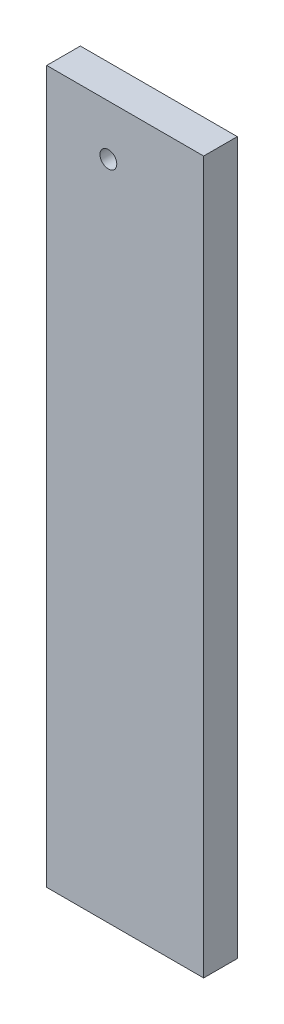
ISO-10303-21;
HEADER;
FILE_DESCRIPTION(('STEP AP214'),'2;1');
FILE_NAME('part.step','',(''),(''),'','','');
FILE_SCHEMA(('AUTOMOTIVE_DESIGN { 1 0 10303 214 1 1 1 1 }'));
ENDSEC;
DATA;
#1=APPLICATION_CONTEXT('core data for automotive mechanical design processes');
#2=APPLICATION_PROTOCOL_DEFINITION('international standard','automotive_design',2000,#1);
#3=PRODUCT_CONTEXT('',#1,'mechanical');
#4=PRODUCT('Part','Part','',(#3));
#5=PRODUCT_RELATED_PRODUCT_CATEGORY('part','',(#4));
#6=PRODUCT_DEFINITION_FORMATION('','',#4);
#7=PRODUCT_DEFINITION_CONTEXT('part definition',#1,'design');
#8=PRODUCT_DEFINITION('design','',#6,#7);
#9=PRODUCT_DEFINITION_SHAPE('','',#8);
#10=(LENGTH_UNIT() NAMED_UNIT(*) SI_UNIT(.MILLI.,.METRE.));
#11=(NAMED_UNIT(*) PLANE_ANGLE_UNIT() SI_UNIT($,.RADIAN.));
#12=(NAMED_UNIT(*) SI_UNIT($,.STERADIAN.) SOLID_ANGLE_UNIT());
#13=UNCERTAINTY_MEASURE_WITH_UNIT(LENGTH_MEASURE(1.E-05),#10,'distance_accuracy_value','');
#14=(GEOMETRIC_REPRESENTATION_CONTEXT(3) GLOBAL_UNCERTAINTY_ASSIGNED_CONTEXT((#13)) GLOBAL_UNIT_ASSIGNED_CONTEXT((#10,
#11,#12)) REPRESENTATION_CONTEXT('',''));
#15=CARTESIAN_POINT('',(0.,0.,0.));
#16=DIRECTION('',(0.,0.,1.));
#17=DIRECTION('',(1.,0.,0.));
#18=AXIS2_PLACEMENT_3D('',#15,#16,#17);
#19=CARTESIAN_POINT('',(-44.45,201.6125,9.525));
#20=DIRECTION('',(1.,0.,0.));
#21=DIRECTION('',(0.,1.,0.));
#22=AXIS2_PLACEMENT_3D('',#19,#20,#21);
#23=PLANE('',#22);
#24=DIRECTION('',(0.,-1.,0.));
#25=VECTOR('',#24,1.);
#26=CARTESIAN_POINT('',(-44.45,201.6125,-9.525));
#27=LINE('',#26,#25);
#28=CARTESIAN_POINT('',(-44.45,201.6125,-9.525));
#29=VERTEX_POINT('',#28);
#30=CARTESIAN_POINT('',(-44.45,-201.6125,-9.525));
#31=VERTEX_POINT('',#30);
#32=EDGE_CURVE('E95',#29,#31,#27,.T.);
#33=ORIENTED_EDGE('',*,*,#32,.T.);
#34=DIRECTION('',(0.,0.,-1.));
#35=VECTOR('',#34,1.);
#36=CARTESIAN_POINT('',(-44.45,-201.6125,9.525));
#37=LINE('',#36,#35);
#38=CARTESIAN_POINT('',(-44.45,-201.6125,9.525));
#39=VERTEX_POINT('',#38);
#40=EDGE_CURVE('E11',#39,#31,#37,.T.);
#41=ORIENTED_EDGE('',*,*,#40,.F.);
#42=DIRECTION('',(0.,-1.,0.));
#43=VECTOR('',#42,1.);
#44=CARTESIAN_POINT('',(-44.45,201.6125,9.525));
#45=LINE('',#44,#43);
#46=CARTESIAN_POINT('',(-44.45,201.6125,9.525));
#47=VERTEX_POINT('',#46);
#48=EDGE_CURVE('E83',#47,#39,#45,.T.);
#49=ORIENTED_EDGE('',*,*,#48,.F.);
#50=DIRECTION('',(0.,0.,-1.));
#51=VECTOR('',#50,1.);
#52=CARTESIAN_POINT('',(-44.45,201.6125,9.525));
#53=LINE('',#52,#51);
#54=EDGE_CURVE('E91',#47,#29,#53,.T.);
#55=ORIENTED_EDGE('',*,*,#54,.T.);
#56=EDGE_LOOP('',(#33,#41,#49,#55));
#57=FACE_BOUND('',#56,.T.);
#58=ADVANCED_FACE('F32',(#57),#23,.F.);
#59=CARTESIAN_POINT('',(44.45,-201.6125,9.525));
#60=DIRECTION('',(0.,1.,0.));
#61=DIRECTION('',(0.,0.,1.));
#62=AXIS2_PLACEMENT_3D('',#59,#60,#61);
#63=PLANE('',#62);
#64=DIRECTION('',(1.,0.,0.));
#65=VECTOR('',#64,1.);
#66=CARTESIAN_POINT('',(44.45,-201.6125,-9.525));
#67=LINE('',#66,#65);
#68=CARTESIAN_POINT('',(44.45,-201.6125,-9.525));
#69=VERTEX_POINT('',#68);
#70=EDGE_CURVE('E87',#31,#69,#67,.T.);
#71=ORIENTED_EDGE('',*,*,#70,.T.);
#72=DIRECTION('',(0.,0.,-1.));
#73=VECTOR('',#72,1.);
#74=CARTESIAN_POINT('',(44.45,-201.6125,9.525));
#75=LINE('',#74,#73);
#76=CARTESIAN_POINT('',(44.45,-201.6125,9.525));
#77=VERTEX_POINT('',#76);
#78=EDGE_CURVE('E40',#77,#69,#75,.T.);
#79=ORIENTED_EDGE('',*,*,#78,.F.);
#80=DIRECTION('',(1.,0.,0.));
#81=VECTOR('',#80,1.);
#82=CARTESIAN_POINT('',(44.45,-201.6125,9.525));
#83=LINE('',#82,#81);
#84=EDGE_CURVE('E78',#39,#77,#83,.T.);
#85=ORIENTED_EDGE('',*,*,#84,.F.);
#86=ORIENTED_EDGE('',*,*,#40,.T.);
#87=EDGE_LOOP('',(#71,#79,#85,#86));
#88=FACE_BOUND('',#87,.T.);
#89=ADVANCED_FACE('F86',(#88),#63,.F.);
#90=CARTESIAN_POINT('',(44.45,201.6125,9.525));
#91=DIRECTION('',(-1.,0.,0.));
#92=DIRECTION('',(0.,-1.,0.));
#93=AXIS2_PLACEMENT_3D('',#90,#91,#92);
#94=PLANE('',#93);
#95=DIRECTION('',(0.,1.,0.));
#96=VECTOR('',#95,1.);
#97=CARTESIAN_POINT('',(44.45,201.6125,-9.525));
#98=LINE('',#97,#96);
#99=CARTESIAN_POINT('',(44.45,201.6125,-9.525));
#100=VERTEX_POINT('',#99);
#101=EDGE_CURVE('E65',#69,#100,#98,.T.);
#102=ORIENTED_EDGE('',*,*,#101,.T.);
#103=DIRECTION('',(0.,0.,-1.));
#104=VECTOR('',#103,1.);
#105=CARTESIAN_POINT('',(44.45,201.6125,9.525));
#106=LINE('',#105,#104);
#107=CARTESIAN_POINT('',(44.45,201.6125,9.525));
#108=VERTEX_POINT('',#107);
#109=EDGE_CURVE('E88',#108,#100,#106,.T.);
#110=ORIENTED_EDGE('',*,*,#109,.F.);
#111=DIRECTION('',(0.,1.,0.));
#112=VECTOR('',#111,1.);
#113=CARTESIAN_POINT('',(44.45,201.6125,9.525));
#114=LINE('',#113,#112);
#115=EDGE_CURVE('E81',#77,#108,#114,.T.);
#116=ORIENTED_EDGE('',*,*,#115,.F.);
#117=ORIENTED_EDGE('',*,*,#78,.T.);
#118=EDGE_LOOP('',(#102,#110,#116,#117));
#119=FACE_BOUND('',#118,.T.);
#120=ADVANCED_FACE('F89',(#119),#94,.F.);
#121=CARTESIAN_POINT('',(44.45,201.6125,9.525));
#122=DIRECTION('',(0.,-1.,0.));
#123=DIRECTION('',(0.,0.,-1.));
#124=AXIS2_PLACEMENT_3D('',#121,#122,#123);
#125=PLANE('',#124);
#126=DIRECTION('',(-1.,0.,0.));
#127=VECTOR('',#126,1.);
#128=CARTESIAN_POINT('',(44.45,201.6125,-9.525));
#129=LINE('',#128,#127);
#130=EDGE_CURVE('E71',#100,#29,#129,.T.);
#131=ORIENTED_EDGE('',*,*,#130,.T.);
#132=ORIENTED_EDGE('',*,*,#54,.F.);
#133=DIRECTION('',(-1.,0.,0.));
#134=VECTOR('',#133,1.);
#135=CARTESIAN_POINT('',(44.45,201.6125,9.525));
#136=LINE('',#135,#134);
#137=EDGE_CURVE('E48',#108,#47,#136,.T.);
#138=ORIENTED_EDGE('',*,*,#137,.F.);
#139=ORIENTED_EDGE('',*,*,#109,.T.);
#140=EDGE_LOOP('',(#131,#132,#138,#139));
#141=FACE_BOUND('',#140,.T.);
#142=ADVANCED_FACE('F103',(#141),#125,.F.);
#143=CARTESIAN_POINT('',(0.,0.,9.525));
#144=DIRECTION('',(0.,0.,-1.));
#145=DIRECTION('',(-1.,0.,0.));
#146=AXIS2_PLACEMENT_3D('',#143,#144,#145);
#147=PLANE('',#146);
#148=CARTESIAN_POINT('',(-9.52499999999997,173.0375,9.525));
#149=DIRECTION('',(0.,0.,-1.));
#150=DIRECTION('',(-1.,0.,0.));
#151=AXIS2_PLACEMENT_3D('',#148,#149,#150);
#152=CIRCLE('',#151,4.7625);
#153=CARTESIAN_POINT('',(-14.2875,173.0375,9.525));
#154=VERTEX_POINT('',#153);
#155=EDGE_CURVE('E98',#154,#154,#152,.T.);
#156=ORIENTED_EDGE('',*,*,#155,.T.);
#157=EDGE_LOOP('',(#156));
#158=FACE_BOUND('',#157,.T.);
#159=ORIENTED_EDGE('',*,*,#48,.T.);
#160=ORIENTED_EDGE('',*,*,#84,.T.);
#161=ORIENTED_EDGE('',*,*,#115,.T.);
#162=ORIENTED_EDGE('',*,*,#137,.T.);
#163=EDGE_LOOP('',(#159,#160,#161,#162));
#164=FACE_BOUND('',#163,.T.);
#165=ADVANCED_FACE('F79',(#158,#164),#147,.F.);
#166=CARTESIAN_POINT('',(0.,0.,-9.525));
#167=DIRECTION('',(0.,0.,-1.));
#168=DIRECTION('',(-1.,0.,0.));
#169=AXIS2_PLACEMENT_3D('',#166,#167,#168);
#170=PLANE('',#169);
#171=CARTESIAN_POINT('',(-9.52499999999997,173.0375,-9.525));
#172=DIRECTION('',(0.,0.,1.));
#173=DIRECTION('',(1.,0.,0.));
#174=AXIS2_PLACEMENT_3D('',#171,#172,#173);
#175=CIRCLE('',#174,4.7625);
#176=CARTESIAN_POINT('',(-4.76249999999997,173.0375,-9.525));
#177=VERTEX_POINT('',#176);
#178=EDGE_CURVE('E111',#177,#177,#175,.T.);
#179=ORIENTED_EDGE('',*,*,#178,.T.);
#180=EDGE_LOOP('',(#179));
#181=FACE_BOUND('',#180,.T.);
#182=ORIENTED_EDGE('',*,*,#32,.F.);
#183=ORIENTED_EDGE('',*,*,#130,.F.);
#184=ORIENTED_EDGE('',*,*,#101,.F.);
#185=ORIENTED_EDGE('',*,*,#70,.F.);
#186=EDGE_LOOP('',(#182,#183,#184,#185));
#187=FACE_BOUND('',#186,.T.);
#188=ADVANCED_FACE('F106',(#181,#187),#170,.T.);
#189=CARTESIAN_POINT('',(-9.52499999999997,173.0375,-9.525));
#190=DIRECTION('',(0.,0.,1.));
#191=DIRECTION('',(1.,0.,0.));
#192=AXIS2_PLACEMENT_3D('',#189,#190,#191);
#193=CYLINDRICAL_SURFACE('',#192,4.7625);
#194=ORIENTED_EDGE('',*,*,#178,.F.);
#195=EDGE_LOOP('',(#194));
#196=FACE_BOUND('',#195,.T.);
#197=ORIENTED_EDGE('',*,*,#155,.F.);
#198=EDGE_LOOP('',(#197));
#199=FACE_BOUND('',#198,.T.);
#200=ADVANCED_FACE('F116',(#196,#199),#193,.F.);
#201=CLOSED_SHELL('',(#58,#89,#120,#142,#165,#188,#200));
#202=MANIFOLD_SOLID_BREP('B2',#201);
#203=ADVANCED_BREP_SHAPE_REPRESENTATION('',(#18,#202),#14);
#204=SHAPE_DEFINITION_REPRESENTATION(#9,#203);
ENDSEC;
END-ISO-10303-21;
